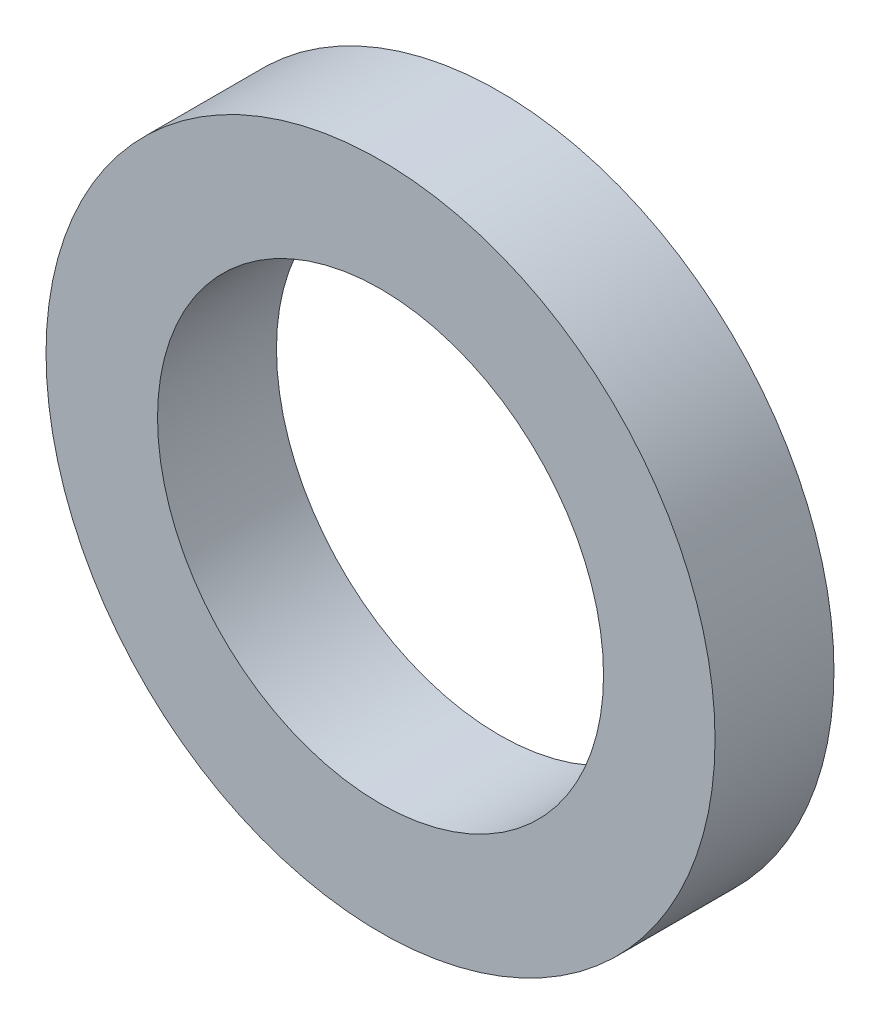
ISO-10303-21;
HEADER;
FILE_DESCRIPTION(('STEP AP214'),'2;1');
FILE_NAME('part.step','',(''),(''),'','','');
FILE_SCHEMA(('AUTOMOTIVE_DESIGN { 1 0 10303 214 1 1 1 1 }'));
ENDSEC;
DATA;
#1=APPLICATION_CONTEXT('core data for automotive mechanical design processes');
#2=APPLICATION_PROTOCOL_DEFINITION('international standard','automotive_design',2000,#1);
#3=PRODUCT_CONTEXT('',#1,'mechanical');
#4=PRODUCT('Part','Part','',(#3));
#5=PRODUCT_RELATED_PRODUCT_CATEGORY('part','',(#4));
#6=PRODUCT_DEFINITION_FORMATION('','',#4);
#7=PRODUCT_DEFINITION_CONTEXT('part definition',#1,'design');
#8=PRODUCT_DEFINITION('design','',#6,#7);
#9=PRODUCT_DEFINITION_SHAPE('','',#8);
#10=(LENGTH_UNIT() NAMED_UNIT(*) SI_UNIT(.MILLI.,.METRE.));
#11=(NAMED_UNIT(*) PLANE_ANGLE_UNIT() SI_UNIT($,.RADIAN.));
#12=(NAMED_UNIT(*) SI_UNIT($,.STERADIAN.) SOLID_ANGLE_UNIT());
#13=UNCERTAINTY_MEASURE_WITH_UNIT(LENGTH_MEASURE(1.E-05),#10,'distance_accuracy_value','');
#14=(GEOMETRIC_REPRESENTATION_CONTEXT(3) GLOBAL_UNCERTAINTY_ASSIGNED_CONTEXT((#13)) GLOBAL_UNIT_ASSIGNED_CONTEXT((#10,
#11,#12)) REPRESENTATION_CONTEXT('',''));
#15=CARTESIAN_POINT('',(0.,0.,0.));
#16=DIRECTION('',(0.,0.,1.));
#17=DIRECTION('',(1.,0.,0.));
#18=AXIS2_PLACEMENT_3D('',#15,#16,#17);
#19=CARTESIAN_POINT('',(0.,0.,1.6));
#20=DIRECTION('',(0.,0.,1.));
#21=DIRECTION('',(1.,0.,0.));
#22=AXIS2_PLACEMENT_3D('',#19,#20,#21);
#23=PLANE('',#22);
#24=CARTESIAN_POINT('',(0.,0.,1.6));
#25=DIRECTION('',(0.,0.,1.));
#26=DIRECTION('',(1.,0.,0.));
#27=AXIS2_PLACEMENT_3D('',#24,#25,#26);
#28=CIRCLE('',#27,4.5);
#29=CARTESIAN_POINT('',(4.5,0.,1.6));
#30=VERTEX_POINT('',#29);
#31=EDGE_CURVE('E10',#30,#30,#28,.T.);
#32=ORIENTED_EDGE('',*,*,#31,.T.);
#33=EDGE_LOOP('',(#32));
#34=FACE_BOUND('',#33,.T.);
#35=CARTESIAN_POINT('',(0.,0.,1.6));
#36=DIRECTION('',(0.,0.,1.));
#37=DIRECTION('',(1.,0.,0.));
#38=AXIS2_PLACEMENT_3D('',#35,#36,#37);
#39=CIRCLE('',#38,3.);
#40=CARTESIAN_POINT('',(3.,0.,1.6));
#41=VERTEX_POINT('',#40);
#42=EDGE_CURVE('E42',#41,#41,#39,.T.);
#43=ORIENTED_EDGE('',*,*,#42,.F.);
#44=EDGE_LOOP('',(#43));
#45=FACE_BOUND('',#44,.T.);
#46=ADVANCED_FACE('F31',(#34,#45),#23,.T.);
#47=CARTESIAN_POINT('',(0.,0.,0.));
#48=DIRECTION('',(0.,0.,1.));
#49=DIRECTION('',(1.,0.,0.));
#50=AXIS2_PLACEMENT_3D('',#47,#48,#49);
#51=PLANE('',#50);
#52=CARTESIAN_POINT('',(0.,0.,0.));
#53=DIRECTION('',(0.,0.,1.));
#54=DIRECTION('',(1.,0.,0.));
#55=AXIS2_PLACEMENT_3D('',#52,#53,#54);
#56=CIRCLE('',#55,4.5);
#57=CARTESIAN_POINT('',(4.5,0.,0.));
#58=VERTEX_POINT('',#57);
#59=EDGE_CURVE('E35',#58,#58,#56,.T.);
#60=ORIENTED_EDGE('',*,*,#59,.F.);
#61=EDGE_LOOP('',(#60));
#62=FACE_BOUND('',#61,.T.);
#63=CARTESIAN_POINT('',(0.,0.,0.));
#64=DIRECTION('',(0.,0.,1.));
#65=DIRECTION('',(1.,0.,0.));
#66=AXIS2_PLACEMENT_3D('',#63,#64,#65);
#67=CIRCLE('',#66,3.);
#68=CARTESIAN_POINT('',(3.,0.,0.));
#69=VERTEX_POINT('',#68);
#70=EDGE_CURVE('E44',#69,#69,#67,.T.);
#71=ORIENTED_EDGE('',*,*,#70,.T.);
#72=EDGE_LOOP('',(#71));
#73=FACE_BOUND('',#72,.T.);
#74=ADVANCED_FACE('F54',(#62,#73),#51,.F.);
#75=CARTESIAN_POINT('',(0.,0.,1.6));
#76=DIRECTION('',(0.,0.,-1.));
#77=DIRECTION('',(-1.,0.,0.));
#78=AXIS2_PLACEMENT_3D('',#75,#76,#77);
#79=CYLINDRICAL_SURFACE('',#78,4.5);
#80=ORIENTED_EDGE('',*,*,#31,.F.);
#81=EDGE_LOOP('',(#80));
#82=FACE_BOUND('',#81,.T.);
#83=ORIENTED_EDGE('',*,*,#59,.T.);
#84=EDGE_LOOP('',(#83));
#85=FACE_BOUND('',#84,.T.);
#86=ADVANCED_FACE('F33',(#82,#85),#79,.T.);
#87=CARTESIAN_POINT('',(0.,0.,1.6));
#88=DIRECTION('',(0.,0.,-1.));
#89=DIRECTION('',(-1.,0.,0.));
#90=AXIS2_PLACEMENT_3D('',#87,#88,#89);
#91=CYLINDRICAL_SURFACE('',#90,3.);
#92=ORIENTED_EDGE('',*,*,#42,.T.);
#93=EDGE_LOOP('',(#92));
#94=FACE_BOUND('',#93,.T.);
#95=ORIENTED_EDGE('',*,*,#70,.F.);
#96=EDGE_LOOP('',(#95));
#97=FACE_BOUND('',#96,.T.);
#98=ADVANCED_FACE('F50',(#94,#97),#91,.F.);
#99=CLOSED_SHELL('',(#46,#74,#86,#98));
#100=MANIFOLD_SOLID_BREP('B2',#99);
#101=ADVANCED_BREP_SHAPE_REPRESENTATION('',(#18,#100),#14);
#102=SHAPE_DEFINITION_REPRESENTATION(#9,#101);
ENDSEC;
END-ISO-10303-21;
